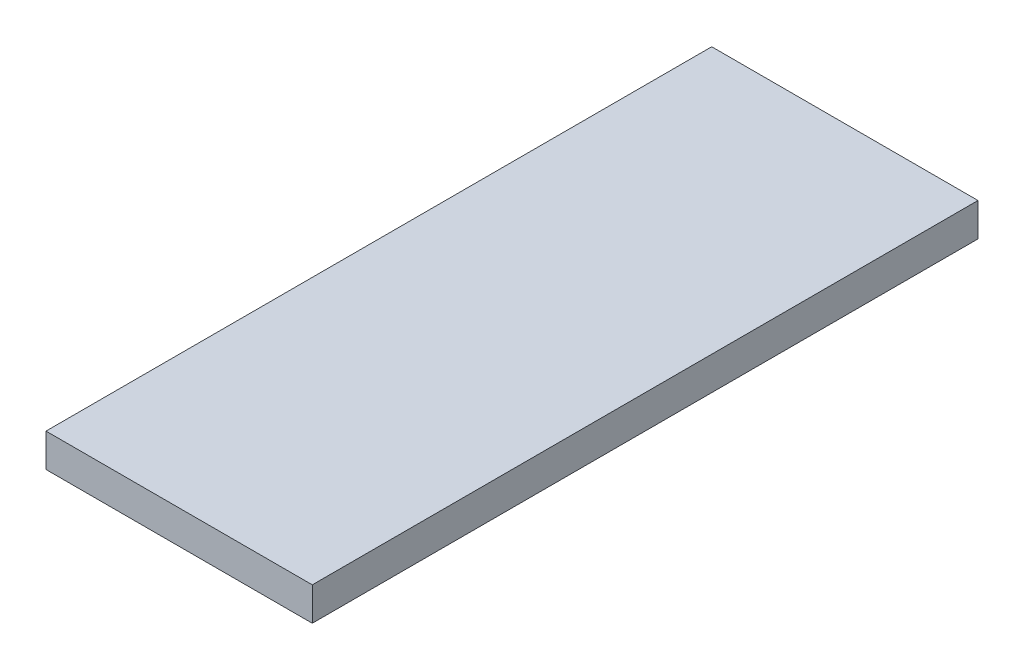
ISO-10303-21;
HEADER;
FILE_DESCRIPTION(('STEP AP214'),'2;1');
FILE_NAME('part.step','',(''),(''),'','','');
FILE_SCHEMA(('AUTOMOTIVE_DESIGN { 1 0 10303 214 1 1 1 1 }'));
ENDSEC;
DATA;
#1=APPLICATION_CONTEXT('core data for automotive mechanical design processes');
#2=APPLICATION_PROTOCOL_DEFINITION('international standard','automotive_design',2000,#1);
#3=PRODUCT_CONTEXT('',#1,'mechanical');
#4=PRODUCT('Part','Part','',(#3));
#5=PRODUCT_RELATED_PRODUCT_CATEGORY('part','',(#4));
#6=PRODUCT_DEFINITION_FORMATION('','',#4);
#7=PRODUCT_DEFINITION_CONTEXT('part definition',#1,'design');
#8=PRODUCT_DEFINITION('design','',#6,#7);
#9=PRODUCT_DEFINITION_SHAPE('','',#8);
#10=(LENGTH_UNIT() NAMED_UNIT(*) SI_UNIT(.MILLI.,.METRE.));
#11=(NAMED_UNIT(*) PLANE_ANGLE_UNIT() SI_UNIT($,.RADIAN.));
#12=(NAMED_UNIT(*) SI_UNIT($,.STERADIAN.) SOLID_ANGLE_UNIT());
#13=UNCERTAINTY_MEASURE_WITH_UNIT(LENGTH_MEASURE(1.E-05),#10,'distance_accuracy_value','');
#14=(GEOMETRIC_REPRESENTATION_CONTEXT(3) GLOBAL_UNCERTAINTY_ASSIGNED_CONTEXT((#13)) GLOBAL_UNIT_ASSIGNED_CONTEXT((#10,
#11,#12)) REPRESENTATION_CONTEXT('',''));
#15=CARTESIAN_POINT('',(0.,0.,0.));
#16=DIRECTION('',(0.,0.,1.));
#17=DIRECTION('',(1.,0.,0.));
#18=AXIS2_PLACEMENT_3D('',#15,#16,#17);
#19=CARTESIAN_POINT('',(0.,5.,0.));
#20=DIRECTION('',(1.,0.,0.));
#21=DIRECTION('',(0.,0.,-1.));
#22=AXIS2_PLACEMENT_3D('',#19,#20,#21);
#23=PLANE('',#22);
#24=DIRECTION('',(0.,0.,1.));
#25=VECTOR('',#24,1.);
#26=CARTESIAN_POINT('',(0.,0.,0.));
#27=LINE('',#26,#25);
#28=CARTESIAN_POINT('',(0.,0.,-100.));
#29=VERTEX_POINT('',#28);
#30=CARTESIAN_POINT('',(0.,0.,0.));
#31=VERTEX_POINT('',#30);
#32=EDGE_CURVE('E98',#29,#31,#27,.T.);
#33=ORIENTED_EDGE('',*,*,#32,.T.);
#34=DIRECTION('',(0.,-1.,0.));
#35=VECTOR('',#34,1.);
#36=CARTESIAN_POINT('',(0.,5.,0.));
#37=LINE('',#36,#35);
#38=CARTESIAN_POINT('',(0.,5.,0.));
#39=VERTEX_POINT('',#38);
#40=EDGE_CURVE('E11',#39,#31,#37,.T.);
#41=ORIENTED_EDGE('',*,*,#40,.F.);
#42=DIRECTION('',(0.,0.,1.));
#43=VECTOR('',#42,1.);
#44=CARTESIAN_POINT('',(0.,5.,0.));
#45=LINE('',#44,#43);
#46=CARTESIAN_POINT('',(0.,5.,-100.));
#47=VERTEX_POINT('',#46);
#48=EDGE_CURVE('E86',#47,#39,#45,.T.);
#49=ORIENTED_EDGE('',*,*,#48,.F.);
#50=DIRECTION('',(0.,-1.,0.));
#51=VECTOR('',#50,1.);
#52=CARTESIAN_POINT('',(0.,5.,-100.));
#53=LINE('',#52,#51);
#54=EDGE_CURVE('E94',#47,#29,#53,.T.);
#55=ORIENTED_EDGE('',*,*,#54,.T.);
#56=EDGE_LOOP('',(#33,#41,#49,#55));
#57=FACE_BOUND('',#56,.T.);
#58=ADVANCED_FACE('F35',(#57),#23,.F.);
#59=CARTESIAN_POINT('',(0.,5.,0.));
#60=DIRECTION('',(0.,0.,-1.));
#61=DIRECTION('',(-1.,0.,0.));
#62=AXIS2_PLACEMENT_3D('',#59,#60,#61);
#63=PLANE('',#62);
#64=DIRECTION('',(1.,0.,0.));
#65=VECTOR('',#64,1.);
#66=CARTESIAN_POINT('',(0.,0.,0.));
#67=LINE('',#66,#65);
#68=CARTESIAN_POINT('',(40.,0.,0.));
#69=VERTEX_POINT('',#68);
#70=EDGE_CURVE('E90',#31,#69,#67,.T.);
#71=ORIENTED_EDGE('',*,*,#70,.T.);
#72=DIRECTION('',(0.,-1.,0.));
#73=VECTOR('',#72,1.);
#74=CARTESIAN_POINT('',(40.,5.,0.));
#75=LINE('',#74,#73);
#76=CARTESIAN_POINT('',(40.,5.,0.));
#77=VERTEX_POINT('',#76);
#78=EDGE_CURVE('E43',#77,#69,#75,.T.);
#79=ORIENTED_EDGE('',*,*,#78,.F.);
#80=DIRECTION('',(1.,0.,0.));
#81=VECTOR('',#80,1.);
#82=CARTESIAN_POINT('',(0.,5.,0.));
#83=LINE('',#82,#81);
#84=EDGE_CURVE('E81',#39,#77,#83,.T.);
#85=ORIENTED_EDGE('',*,*,#84,.F.);
#86=ORIENTED_EDGE('',*,*,#40,.T.);
#87=EDGE_LOOP('',(#71,#79,#85,#86));
#88=FACE_BOUND('',#87,.T.);
#89=ADVANCED_FACE('F89',(#88),#63,.F.);
#90=CARTESIAN_POINT('',(40.,5.,0.));
#91=DIRECTION('',(-1.,0.,0.));
#92=DIRECTION('',(0.,0.,1.));
#93=AXIS2_PLACEMENT_3D('',#90,#91,#92);
#94=PLANE('',#93);
#95=DIRECTION('',(0.,0.,-1.));
#96=VECTOR('',#95,1.);
#97=CARTESIAN_POINT('',(40.,0.,0.));
#98=LINE('',#97,#96);
#99=CARTESIAN_POINT('',(40.,0.,-100.));
#100=VERTEX_POINT('',#99);
#101=EDGE_CURVE('E68',#69,#100,#98,.T.);
#102=ORIENTED_EDGE('',*,*,#101,.T.);
#103=DIRECTION('',(0.,-1.,0.));
#104=VECTOR('',#103,1.);
#105=CARTESIAN_POINT('',(40.,5.,-100.));
#106=LINE('',#105,#104);
#107=CARTESIAN_POINT('',(40.,5.,-100.));
#108=VERTEX_POINT('',#107);
#109=EDGE_CURVE('E91',#108,#100,#106,.T.);
#110=ORIENTED_EDGE('',*,*,#109,.F.);
#111=DIRECTION('',(0.,0.,-1.));
#112=VECTOR('',#111,1.);
#113=CARTESIAN_POINT('',(40.,5.,0.));
#114=LINE('',#113,#112);
#115=EDGE_CURVE('E84',#77,#108,#114,.T.);
#116=ORIENTED_EDGE('',*,*,#115,.F.);
#117=ORIENTED_EDGE('',*,*,#78,.T.);
#118=EDGE_LOOP('',(#102,#110,#116,#117));
#119=FACE_BOUND('',#118,.T.);
#120=ADVANCED_FACE('F92',(#119),#94,.F.);
#121=CARTESIAN_POINT('',(0.,5.,-100.));
#122=DIRECTION('',(0.,0.,1.));
#123=DIRECTION('',(1.,0.,0.));
#124=AXIS2_PLACEMENT_3D('',#121,#122,#123);
#125=PLANE('',#124);
#126=DIRECTION('',(-1.,0.,0.));
#127=VECTOR('',#126,1.);
#128=CARTESIAN_POINT('',(0.,0.,-100.));
#129=LINE('',#128,#127);
#130=EDGE_CURVE('E74',#100,#29,#129,.T.);
#131=ORIENTED_EDGE('',*,*,#130,.T.);
#132=ORIENTED_EDGE('',*,*,#54,.F.);
#133=DIRECTION('',(-1.,0.,0.));
#134=VECTOR('',#133,1.);
#135=CARTESIAN_POINT('',(0.,5.,-100.));
#136=LINE('',#135,#134);
#137=EDGE_CURVE('E51',#108,#47,#136,.T.);
#138=ORIENTED_EDGE('',*,*,#137,.F.);
#139=ORIENTED_EDGE('',*,*,#109,.T.);
#140=EDGE_LOOP('',(#131,#132,#138,#139));
#141=FACE_BOUND('',#140,.T.);
#142=ADVANCED_FACE('F105',(#141),#125,.F.);
#143=CARTESIAN_POINT('',(0.,5.,0.));
#144=DIRECTION('',(0.,-1.,0.));
#145=DIRECTION('',(0.,0.,-1.));
#146=AXIS2_PLACEMENT_3D('',#143,#144,#145);
#147=PLANE('',#146);
#148=ORIENTED_EDGE('',*,*,#48,.T.);
#149=ORIENTED_EDGE('',*,*,#84,.T.);
#150=ORIENTED_EDGE('',*,*,#115,.T.);
#151=ORIENTED_EDGE('',*,*,#137,.T.);
#152=EDGE_LOOP('',(#148,#149,#150,#151));
#153=FACE_BOUND('',#152,.T.);
#154=ADVANCED_FACE('F82',(#153),#147,.F.);
#155=CARTESIAN_POINT('',(0.,0.,0.));
#156=DIRECTION('',(0.,-1.,0.));
#157=DIRECTION('',(0.,0.,-1.));
#158=AXIS2_PLACEMENT_3D('',#155,#156,#157);
#159=PLANE('',#158);
#160=ORIENTED_EDGE('',*,*,#32,.F.);
#161=ORIENTED_EDGE('',*,*,#130,.F.);
#162=ORIENTED_EDGE('',*,*,#101,.F.);
#163=ORIENTED_EDGE('',*,*,#70,.F.);
#164=EDGE_LOOP('',(#160,#161,#162,#163));
#165=FACE_BOUND('',#164,.T.);
#166=ADVANCED_FACE('F108',(#165),#159,.T.);
#167=CLOSED_SHELL('',(#58,#89,#120,#142,#154,#166));
#168=MANIFOLD_SOLID_BREP('B2',#167);
#169=ADVANCED_BREP_SHAPE_REPRESENTATION('',(#18,#168),#14);
#170=SHAPE_DEFINITION_REPRESENTATION(#9,#169);
ENDSEC;
END-ISO-10303-21;
